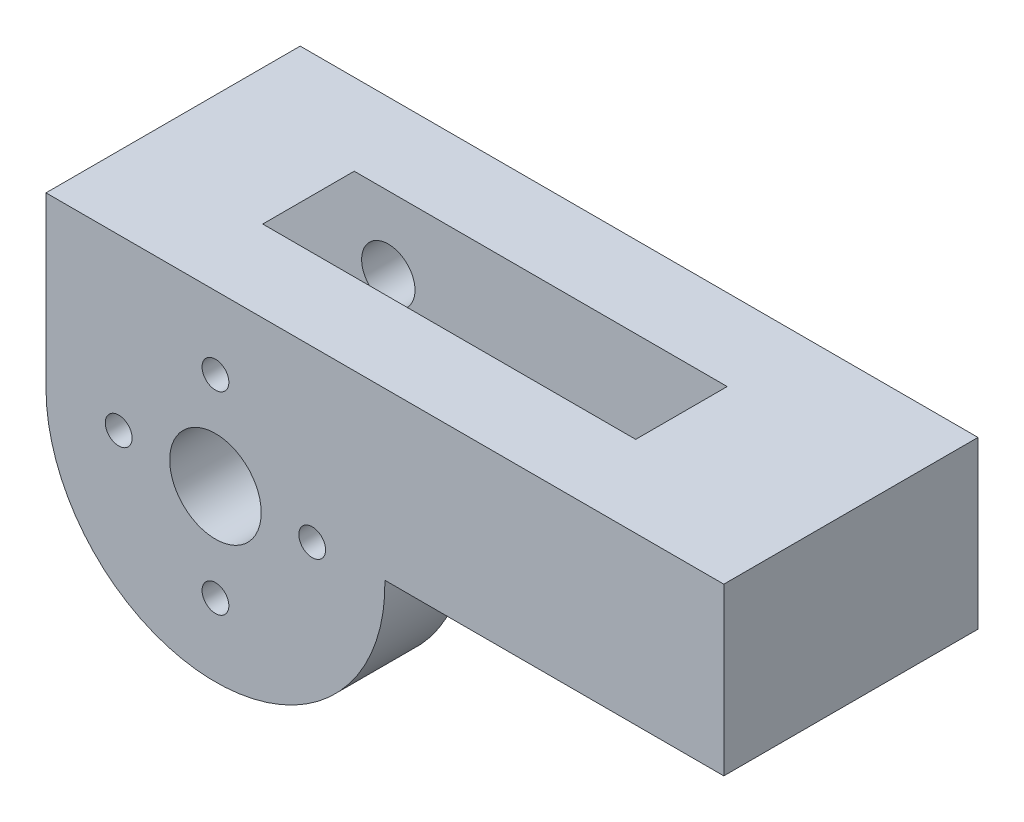
ISO-10303-21;
HEADER;
FILE_DESCRIPTION(('STEP AP214'),'2;1');
FILE_NAME('part.step','',(''),(''),'','','');
FILE_SCHEMA(('AUTOMOTIVE_DESIGN { 1 0 10303 214 1 1 1 1 }'));
ENDSEC;
DATA;
#1=APPLICATION_CONTEXT('core data for automotive mechanical design processes');
#2=APPLICATION_PROTOCOL_DEFINITION('international standard','automotive_design',2000,#1);
#3=PRODUCT_CONTEXT('',#1,'mechanical');
#4=PRODUCT('Part','Part','',(#3));
#5=PRODUCT_RELATED_PRODUCT_CATEGORY('part','',(#4));
#6=PRODUCT_DEFINITION_FORMATION('','',#4);
#7=PRODUCT_DEFINITION_CONTEXT('part definition',#1,'design');
#8=PRODUCT_DEFINITION('design','',#6,#7);
#9=PRODUCT_DEFINITION_SHAPE('','',#8);
#10=(LENGTH_UNIT() NAMED_UNIT(*) SI_UNIT(.MILLI.,.METRE.));
#11=(NAMED_UNIT(*) PLANE_ANGLE_UNIT() SI_UNIT($,.RADIAN.));
#12=(NAMED_UNIT(*) SI_UNIT($,.STERADIAN.) SOLID_ANGLE_UNIT());
#13=UNCERTAINTY_MEASURE_WITH_UNIT(LENGTH_MEASURE(1.E-05),#10,'distance_accuracy_value','');
#14=(GEOMETRIC_REPRESENTATION_CONTEXT(3) GLOBAL_UNCERTAINTY_ASSIGNED_CONTEXT((#13)) GLOBAL_UNIT_ASSIGNED_CONTEXT((#10,
#11,#12)) REPRESENTATION_CONTEXT('',''));
#15=CARTESIAN_POINT('',(0.,0.,0.));
#16=DIRECTION('',(0.,0.,1.));
#17=DIRECTION('',(1.,0.,0.));
#18=AXIS2_PLACEMENT_3D('',#15,#16,#17);
#19=CARTESIAN_POINT('',(0.,0.,9.525));
#20=DIRECTION('',(0.,0.,-1.));
#21=DIRECTION('',(-1.,0.,0.));
#22=AXIS2_PLACEMENT_3D('',#19,#20,#21);
#23=CYLINDRICAL_SURFACE('',#22,12.7);
#24=CARTESIAN_POINT('',(0.,0.,-3.429));
#25=DIRECTION('',(0.,0.,1.));
#26=DIRECTION('',(1.,0.,0.));
#27=AXIS2_PLACEMENT_3D('',#24,#25,#26);
#28=CIRCLE('',#27,12.7);
#29=CARTESIAN_POINT('',(-12.7,0.,-3.429));
#30=VERTEX_POINT('',#29);
#31=CARTESIAN_POINT('',(12.6974597459492,0.254000000000002,-3.429));
#32=VERTEX_POINT('',#31);
#33=EDGE_CURVE('E141',#30,#32,#28,.T.);
#34=ORIENTED_EDGE('',*,*,#33,.F.);
#35=DIRECTION('',(0.,0.,-1.));
#36=VECTOR('',#35,1.);
#37=CARTESIAN_POINT('',(-12.7,0.,9.525));
#38=LINE('',#37,#36);
#39=CARTESIAN_POINT('',(-12.7,0.,-9.525));
#40=VERTEX_POINT('',#39);
#41=EDGE_CURVE('E185',#30,#40,#38,.T.);
#42=ORIENTED_EDGE('',*,*,#41,.T.);
#43=CARTESIAN_POINT('',(0.,0.,-9.525));
#44=DIRECTION('',(0.,0.,1.));
#45=DIRECTION('',(1.,0.,0.));
#46=AXIS2_PLACEMENT_3D('',#43,#44,#45);
#47=CIRCLE('',#46,12.7);
#48=CARTESIAN_POINT('',(12.6974597459492,0.254000000000002,-9.525));
#49=VERTEX_POINT('',#48);
#50=EDGE_CURVE('E170',#40,#49,#47,.T.);
#51=ORIENTED_EDGE('',*,*,#50,.T.);
#52=DIRECTION('',(0.,0.,-1.));
#53=VECTOR('',#52,1.);
#54=CARTESIAN_POINT('',(12.6974597459492,0.254000000000002,9.525));
#55=LINE('',#54,#53);
#56=EDGE_CURVE('E208',#32,#49,#55,.T.);
#57=ORIENTED_EDGE('',*,*,#56,.F.);
#58=EDGE_LOOP('',(#34,#42,#51,#57));
#59=FACE_BOUND('',#58,.T.);
#60=ADVANCED_FACE('F40',(#59),#23,.T.);
#61=CARTESIAN_POINT('',(38.1,0.254000000000005,9.525));
#62=DIRECTION('',(0.,1.,0.));
#63=DIRECTION('',(-1.,0.,0.));
#64=AXIS2_PLACEMENT_3D('',#61,#62,#63);
#65=PLANE('',#64);
#66=DIRECTION('',(1.,0.,0.));
#67=VECTOR('',#66,1.);
#68=CARTESIAN_POINT('',(-399987.3,0.253999999927146,-3.429));
#69=LINE('',#68,#67);
#70=CARTESIAN_POINT('',(25.3999999999661,0.253999999983989,-3.429));
#71=VERTEX_POINT('',#70);
#72=EDGE_CURVE('E136',#32,#71,#69,.T.);
#73=ORIENTED_EDGE('',*,*,#72,.F.);
#74=ORIENTED_EDGE('',*,*,#56,.T.);
#75=DIRECTION('',(1.,0.,0.));
#76=VECTOR('',#75,1.);
#77=CARTESIAN_POINT('',(38.1,0.254000000000005,-9.525));
#78=LINE('',#77,#76);
#79=CARTESIAN_POINT('',(38.1,0.254000000000005,-9.525));
#80=VERTEX_POINT('',#79);
#81=EDGE_CURVE('E188',#49,#80,#78,.T.);
#82=ORIENTED_EDGE('',*,*,#81,.T.);
#83=DIRECTION('',(0.,0.,-1.));
#84=VECTOR('',#83,1.);
#85=CARTESIAN_POINT('',(38.1,0.254000000000005,9.525));
#86=LINE('',#85,#84);
#87=CARTESIAN_POINT('',(38.1,0.254000000000005,9.525));
#88=VERTEX_POINT('',#87);
#89=EDGE_CURVE('E205',#88,#80,#86,.T.);
#90=ORIENTED_EDGE('',*,*,#89,.F.);
#91=DIRECTION('',(1.,0.,0.));
#92=VECTOR('',#91,1.);
#93=CARTESIAN_POINT('',(38.1,0.254000000000005,9.525));
#94=LINE('',#93,#92);
#95=CARTESIAN_POINT('',(12.6974597459492,0.254000000000002,9.525));
#96=VERTEX_POINT('',#95);
#97=EDGE_CURVE('E176',#96,#88,#94,.T.);
#98=ORIENTED_EDGE('',*,*,#97,.F.);
#99=CARTESIAN_POINT('',(12.6974597459492,0.254000000000002,3.429));
#100=VERTEX_POINT('',#99);
#101=EDGE_CURVE('E49',#96,#100,#55,.T.);
#102=ORIENTED_EDGE('',*,*,#101,.T.);
#103=DIRECTION('',(1.,0.,0.));
#104=VECTOR('',#103,1.);
#105=CARTESIAN_POINT('',(38.1,0.254000000000005,3.429));
#106=LINE('',#105,#104);
#107=CARTESIAN_POINT('',(25.3999999999661,0.253999999983989,3.429));
#108=VERTEX_POINT('',#107);
#109=EDGE_CURVE('E148',#100,#108,#106,.T.);
#110=ORIENTED_EDGE('',*,*,#109,.T.);
#111=DIRECTION('',(0.,0.,1.));
#112=VECTOR('',#111,1.);
#113=CARTESIAN_POINT('',(25.3999999999661,0.253999999983989,-3.429));
#114=LINE('',#113,#112);
#115=EDGE_CURVE('E132',#71,#108,#114,.T.);
#116=ORIENTED_EDGE('',*,*,#115,.F.);
#117=EDGE_LOOP('',(#73,#74,#82,#90,#98,#102,#110,#116));
#118=FACE_BOUND('',#117,.T.);
#119=ADVANCED_FACE('F146',(#118),#65,.F.);
#120=CARTESIAN_POINT('',(-12.7,12.7,9.525));
#121=DIRECTION('',(0.,-1.,0.));
#122=DIRECTION('',(0.,0.,-1.));
#123=AXIS2_PLACEMENT_3D('',#120,#121,#122);
#124=PLANE('',#123);
#125=DIRECTION('',(-1.,0.,0.));
#126=VECTOR('',#125,1.);
#127=CARTESIAN_POINT('',(-12.7,12.7,-9.525));
#128=LINE('',#127,#126);
#129=CARTESIAN_POINT('',(38.1,12.7,-9.525));
#130=VERTEX_POINT('',#129);
#131=CARTESIAN_POINT('',(-12.7,12.7,-9.525));
#132=VERTEX_POINT('',#131);
#133=EDGE_CURVE('E192',#130,#132,#128,.T.);
#134=ORIENTED_EDGE('',*,*,#133,.T.);
#135=DIRECTION('',(0.,0.,-1.));
#136=VECTOR('',#135,1.);
#137=CARTESIAN_POINT('',(-12.7,12.7,9.525));
#138=LINE('',#137,#136);
#139=CARTESIAN_POINT('',(-12.7,12.7,9.525));
#140=VERTEX_POINT('',#139);
#141=EDGE_CURVE('E199',#140,#132,#138,.T.);
#142=ORIENTED_EDGE('',*,*,#141,.F.);
#143=DIRECTION('',(-1.,0.,0.));
#144=VECTOR('',#143,1.);
#145=CARTESIAN_POINT('',(-12.7,12.7,9.525));
#146=LINE('',#145,#144);
#147=CARTESIAN_POINT('',(38.1,12.7,9.525));
#148=VERTEX_POINT('',#147);
#149=EDGE_CURVE('E181',#148,#140,#146,.T.);
#150=ORIENTED_EDGE('',*,*,#149,.F.);
#151=DIRECTION('',(0.,0.,-1.));
#152=VECTOR('',#151,1.);
#153=CARTESIAN_POINT('',(38.1,12.7,9.525));
#154=LINE('',#153,#152);
#155=EDGE_CURVE('E202',#148,#130,#154,.T.);
#156=ORIENTED_EDGE('',*,*,#155,.T.);
#157=EDGE_LOOP('',(#134,#142,#150,#156));
#158=FACE_BOUND('',#157,.T.);
#159=DIRECTION('',(-1.,0.,0.));
#160=VECTOR('',#159,1.);
#161=CARTESIAN_POINT('',(-12.7,12.7,-3.429));
#162=LINE('',#161,#160);
#163=CARTESIAN_POINT('',(25.3999999999905,12.6999999999931,-3.429));
#164=VERTEX_POINT('',#163);
#165=CARTESIAN_POINT('',(-2.55266840776471,12.7,-3.429));
#166=VERTEX_POINT('',#165);
#167=EDGE_CURVE('E162',#164,#166,#162,.T.);
#168=ORIENTED_EDGE('',*,*,#167,.F.);
#169=DIRECTION('',(0.,0.,1.));
#170=VECTOR('',#169,1.);
#171=CARTESIAN_POINT('',(25.3999999999905,12.6999999999931,-3.429));
#172=LINE('',#171,#170);
#173=CARTESIAN_POINT('',(25.3999999999905,12.6999999999931,3.429));
#174=VERTEX_POINT('',#173);
#175=EDGE_CURVE('E134',#164,#174,#172,.T.);
#176=ORIENTED_EDGE('',*,*,#175,.T.);
#177=DIRECTION('',(-1.,0.,0.));
#178=VECTOR('',#177,1.);
#179=CARTESIAN_POINT('',(-399987.3,12.6999999999384,3.429));
#180=LINE('',#179,#178);
#181=CARTESIAN_POINT('',(-2.55266840776471,12.7,3.429));
#182=VERTEX_POINT('',#181);
#183=EDGE_CURVE('E57',#174,#182,#180,.T.);
#184=ORIENTED_EDGE('',*,*,#183,.T.);
#185=DIRECTION('',(0.,0.,1.));
#186=VECTOR('',#185,1.);
#187=CARTESIAN_POINT('',(-2.55266840776473,12.7,-3.429));
#188=LINE('',#187,#186);
#189=EDGE_CURVE('E164',#182,#166,#188,.F.);
#190=ORIENTED_EDGE('',*,*,#189,.T.);
#191=EDGE_LOOP('',(#168,#176,#184,#190));
#192=FACE_BOUND('',#191,.T.);
#193=ADVANCED_FACE('F269',(#158,#192),#124,.F.);
#194=CARTESIAN_POINT('',(-12.7,0.,9.525));
#195=DIRECTION('',(1.,0.,0.));
#196=DIRECTION('',(0.,0.,-1.));
#197=AXIS2_PLACEMENT_3D('',#194,#195,#196);
#198=PLANE('',#197);
#199=DIRECTION('',(0.,-1.,0.));
#200=VECTOR('',#199,1.);
#201=CARTESIAN_POINT('',(-12.7,0.,-3.429));
#202=LINE('',#201,#200);
#203=CARTESIAN_POINT('',(-12.7,2.55266840776471,-3.429));
#204=VERTEX_POINT('',#203);
#205=EDGE_CURVE('E159',#204,#30,#202,.T.);
#206=ORIENTED_EDGE('',*,*,#205,.F.);
#207=DIRECTION('',(0.,0.,1.));
#208=VECTOR('',#207,1.);
#209=CARTESIAN_POINT('',(-12.7,2.55266840776473,-3.429));
#210=LINE('',#209,#208);
#211=CARTESIAN_POINT('',(-12.7,2.55266840776471,3.429));
#212=VERTEX_POINT('',#211);
#213=EDGE_CURVE('E13',#204,#212,#210,.T.);
#214=ORIENTED_EDGE('',*,*,#213,.T.);
#215=DIRECTION('',(0.,-1.,0.));
#216=VECTOR('',#215,1.);
#217=CARTESIAN_POINT('',(-12.7,0.,3.429));
#218=LINE('',#217,#216);
#219=CARTESIAN_POINT('',(-12.7,0.,3.429));
#220=VERTEX_POINT('',#219);
#221=EDGE_CURVE('E154',#212,#220,#218,.T.);
#222=ORIENTED_EDGE('',*,*,#221,.T.);
#223=CARTESIAN_POINT('',(-12.7,0.,9.525));
#224=VERTEX_POINT('',#223);
#225=EDGE_CURVE('E196',#224,#220,#38,.T.);
#226=ORIENTED_EDGE('',*,*,#225,.F.);
#227=DIRECTION('',(0.,-1.,0.));
#228=VECTOR('',#227,1.);
#229=CARTESIAN_POINT('',(-12.7,0.,9.525));
#230=LINE('',#229,#228);
#231=EDGE_CURVE('E183',#140,#224,#230,.T.);
#232=ORIENTED_EDGE('',*,*,#231,.F.);
#233=ORIENTED_EDGE('',*,*,#141,.T.);
#234=DIRECTION('',(0.,-1.,0.));
#235=VECTOR('',#234,1.);
#236=CARTESIAN_POINT('',(-12.7,0.,-9.525));
#237=LINE('',#236,#235);
#238=EDGE_CURVE('E177',#132,#40,#237,.T.);
#239=ORIENTED_EDGE('',*,*,#238,.T.);
#240=ORIENTED_EDGE('',*,*,#41,.F.);
#241=EDGE_LOOP('',(#206,#214,#222,#226,#232,#233,#239,#240));
#242=FACE_BOUND('',#241,.T.);
#243=ADVANCED_FACE('F276',(#242),#198,.F.);
#244=CARTESIAN_POINT('',(0.,0.,9.525));
#245=DIRECTION('',(0.,0.,-1.));
#246=DIRECTION('',(-1.,0.,0.));
#247=AXIS2_PLACEMENT_3D('',#244,#245,#246);
#248=CYLINDRICAL_SURFACE('',#247,3.429);
#249=CARTESIAN_POINT('',(0.,0.,-9.525));
#250=DIRECTION('',(0.,0.,1.));
#251=DIRECTION('',(1.,0.,0.));
#252=AXIS2_PLACEMENT_3D('',#249,#250,#251);
#253=CIRCLE('',#252,3.429);
#254=CARTESIAN_POINT('',(3.429,0.,-9.525));
#255=VERTEX_POINT('',#254);
#256=EDGE_CURVE('E166',#255,#255,#253,.T.);
#257=ORIENTED_EDGE('',*,*,#256,.F.);
#258=EDGE_LOOP('',(#257));
#259=FACE_BOUND('',#258,.T.);
#260=CARTESIAN_POINT('',(0.,0.,-3.429));
#261=DIRECTION('',(0.,0.,1.));
#262=DIRECTION('',(1.,0.,0.));
#263=AXIS2_PLACEMENT_3D('',#260,#261,#262);
#264=CIRCLE('',#263,3.429);
#265=CARTESIAN_POINT('',(3.429,0.,-3.429));
#266=VERTEX_POINT('',#265);
#267=EDGE_CURVE('E158',#266,#266,#264,.T.);
#268=ORIENTED_EDGE('',*,*,#267,.T.);
#269=EDGE_LOOP('',(#268));
#270=FACE_BOUND('',#269,.T.);
#271=ADVANCED_FACE('F322',(#259,#270),#248,.F.);
#272=CARTESIAN_POINT('',(0.,0.,9.525));
#273=DIRECTION('',(0.,0.,1.));
#274=DIRECTION('',(1.,0.,0.));
#275=AXIS2_PLACEMENT_3D('',#272,#273,#274);
#276=PLANE('',#275);
#277=CARTESIAN_POINT('',(7.249999978,0.,9.525));
#278=DIRECTION('',(0.,0.,1.));
#279=DIRECTION('',(1.,0.,0.));
#280=AXIS2_PLACEMENT_3D('',#277,#278,#279);
#281=CIRCLE('',#280,1.004000024);
#282=CARTESIAN_POINT('',(8.254000002,0.,9.525));
#283=VERTEX_POINT('',#282);
#284=EDGE_CURVE('E252',#283,#283,#281,.T.);
#285=ORIENTED_EDGE('',*,*,#284,.F.);
#286=EDGE_LOOP('',(#285));
#287=FACE_BOUND('',#286,.T.);
#288=CARTESIAN_POINT('',(0.,-7.249999978,9.525));
#289=DIRECTION('',(0.,0.,1.));
#290=DIRECTION('',(1.,0.,0.));
#291=AXIS2_PLACEMENT_3D('',#288,#289,#290);
#292=CIRCLE('',#291,1.004000024);
#293=CARTESIAN_POINT('',(1.00400002399997,-7.249999978,9.525));
#294=VERTEX_POINT('',#293);
#295=EDGE_CURVE('E256',#294,#294,#292,.T.);
#296=ORIENTED_EDGE('',*,*,#295,.F.);
#297=EDGE_LOOP('',(#296));
#298=FACE_BOUND('',#297,.T.);
#299=CARTESIAN_POINT('',(-7.249999978,0.,9.525));
#300=DIRECTION('',(0.,0.,1.));
#301=DIRECTION('',(1.,0.,0.));
#302=AXIS2_PLACEMENT_3D('',#299,#300,#301);
#303=CIRCLE('',#302,1.004000024);
#304=CARTESIAN_POINT('',(-6.245999954,0.,9.525));
#305=VERTEX_POINT('',#304);
#306=EDGE_CURVE('E259',#305,#305,#303,.T.);
#307=ORIENTED_EDGE('',*,*,#306,.F.);
#308=EDGE_LOOP('',(#307));
#309=FACE_BOUND('',#308,.T.);
#310=CARTESIAN_POINT('',(0.,7.249999978,9.525));
#311=DIRECTION('',(0.,0.,1.));
#312=DIRECTION('',(1.,0.,0.));
#313=AXIS2_PLACEMENT_3D('',#310,#311,#312);
#314=CIRCLE('',#313,1.004000024);
#315=CARTESIAN_POINT('',(1.00400002400008,7.249999978,9.525));
#316=VERTEX_POINT('',#315);
#317=EDGE_CURVE('E251',#316,#316,#314,.T.);
#318=ORIENTED_EDGE('',*,*,#317,.F.);
#319=EDGE_LOOP('',(#318));
#320=FACE_BOUND('',#319,.T.);
#321=CARTESIAN_POINT('',(0.,0.,9.525));
#322=DIRECTION('',(0.,0.,1.));
#323=DIRECTION('',(1.,0.,0.));
#324=AXIS2_PLACEMENT_3D('',#321,#322,#323);
#325=CIRCLE('',#324,12.7);
#326=EDGE_CURVE('E173',#224,#96,#325,.T.);
#327=ORIENTED_EDGE('',*,*,#326,.T.);
#328=ORIENTED_EDGE('',*,*,#97,.T.);
#329=DIRECTION('',(0.,1.,0.));
#330=VECTOR('',#329,1.);
#331=CARTESIAN_POINT('',(38.1,12.7,9.525));
#332=LINE('',#331,#330);
#333=EDGE_CURVE('E179',#88,#148,#332,.T.);
#334=ORIENTED_EDGE('',*,*,#333,.T.);
#335=ORIENTED_EDGE('',*,*,#149,.T.);
#336=ORIENTED_EDGE('',*,*,#231,.T.);
#337=EDGE_LOOP('',(#327,#328,#334,#335,#336));
#338=FACE_BOUND('',#337,.T.);
#339=CARTESIAN_POINT('',(0.,0.,9.525));
#340=DIRECTION('',(0.,0.,1.));
#341=DIRECTION('',(1.,0.,0.));
#342=AXIS2_PLACEMENT_3D('',#339,#340,#341);
#343=CIRCLE('',#342,3.429);
#344=CARTESIAN_POINT('',(3.429,0.,9.525));
#345=VERTEX_POINT('',#344);
#346=EDGE_CURVE('E167',#345,#345,#343,.T.);
#347=ORIENTED_EDGE('',*,*,#346,.F.);
#348=EDGE_LOOP('',(#347));
#349=FACE_BOUND('',#348,.T.);
#350=ADVANCED_FACE('F298',(#287,#298,#309,#320,#338,#349),#276,.T.);
#351=CARTESIAN_POINT('',(0.,0.,-9.525));
#352=DIRECTION('',(0.,0.,1.));
#353=DIRECTION('',(1.,0.,0.));
#354=AXIS2_PLACEMENT_3D('',#351,#352,#353);
#355=PLANE('',#354);
#356=CARTESIAN_POINT('',(-7.249999978,0.,-9.525));
#357=DIRECTION('',(0.,0.,-1.));
#358=DIRECTION('',(-1.,0.,0.));
#359=AXIS2_PLACEMENT_3D('',#356,#357,#358);
#360=CIRCLE('',#359,2.000000064);
#361=CARTESIAN_POINT('',(-9.250000042,0.,-9.525));
#362=VERTEX_POINT('',#361);
#363=EDGE_CURVE('E433',#362,#362,#360,.T.);
#364=ORIENTED_EDGE('',*,*,#363,.F.);
#365=EDGE_LOOP('',(#364));
#366=FACE_BOUND('',#365,.T.);
#367=CARTESIAN_POINT('',(0.,-7.249999978,-9.525));
#368=DIRECTION('',(0.,0.,-1.));
#369=DIRECTION('',(-1.,0.,0.));
#370=AXIS2_PLACEMENT_3D('',#367,#368,#369);
#371=CIRCLE('',#370,2.000000064);
#372=CARTESIAN_POINT('',(-2.00000006400002,-7.249999978,-9.525));
#373=VERTEX_POINT('',#372);
#374=EDGE_CURVE('E430',#373,#373,#371,.T.);
#375=ORIENTED_EDGE('',*,*,#374,.F.);
#376=EDGE_LOOP('',(#375));
#377=FACE_BOUND('',#376,.T.);
#378=CARTESIAN_POINT('',(7.24999997800002,0.,-9.525));
#379=DIRECTION('',(0.,0.,-1.));
#380=DIRECTION('',(-1.,0.,0.));
#381=AXIS2_PLACEMENT_3D('',#378,#379,#380);
#382=CIRCLE('',#381,2.00000006399997);
#383=CARTESIAN_POINT('',(5.24999991400006,0.,-9.525));
#384=VERTEX_POINT('',#383);
#385=EDGE_CURVE('E424',#384,#384,#382,.T.);
#386=ORIENTED_EDGE('',*,*,#385,.F.);
#387=EDGE_LOOP('',(#386));
#388=FACE_BOUND('',#387,.T.);
#389=CARTESIAN_POINT('',(0.,7.24999997800002,-9.525));
#390=DIRECTION('',(0.,0.,-1.));
#391=DIRECTION('',(-1.,0.,0.));
#392=AXIS2_PLACEMENT_3D('',#389,#390,#391);
#393=CIRCLE('',#392,2.00000006399996);
#394=CARTESIAN_POINT('',(-2.0000000639999,7.24999997800002,-9.525));
#395=VERTEX_POINT('',#394);
#396=EDGE_CURVE('E419',#395,#395,#393,.T.);
#397=ORIENTED_EDGE('',*,*,#396,.F.);
#398=EDGE_LOOP('',(#397));
#399=FACE_BOUND('',#398,.T.);
#400=ORIENTED_EDGE('',*,*,#50,.F.);
#401=ORIENTED_EDGE('',*,*,#238,.F.);
#402=ORIENTED_EDGE('',*,*,#133,.F.);
#403=DIRECTION('',(0.,1.,0.));
#404=VECTOR('',#403,1.);
#405=CARTESIAN_POINT('',(38.1,12.7,-9.525));
#406=LINE('',#405,#404);
#407=EDGE_CURVE('E190',#80,#130,#406,.T.);
#408=ORIENTED_EDGE('',*,*,#407,.F.);
#409=ORIENTED_EDGE('',*,*,#81,.F.);
#410=EDGE_LOOP('',(#400,#401,#402,#408,#409));
#411=FACE_BOUND('',#410,.T.);
#412=ORIENTED_EDGE('',*,*,#256,.T.);
#413=EDGE_LOOP('',(#412));
#414=FACE_BOUND('',#413,.T.);
#415=ADVANCED_FACE('F285',(#366,#377,#388,#399,#411,#414),#355,.F.);
#416=ORIENTED_EDGE('',*,*,#225,.T.);
#417=CARTESIAN_POINT('',(0.,0.,3.429));
#418=DIRECTION('',(0.,0.,1.));
#419=DIRECTION('',(1.,0.,0.));
#420=AXIS2_PLACEMENT_3D('',#417,#418,#419);
#421=CIRCLE('',#420,12.7);
#422=EDGE_CURVE('E65',#220,#100,#421,.T.);
#423=ORIENTED_EDGE('',*,*,#422,.T.);
#424=ORIENTED_EDGE('',*,*,#101,.F.);
#425=ORIENTED_EDGE('',*,*,#326,.F.);
#426=EDGE_LOOP('',(#416,#423,#424,#425));
#427=FACE_BOUND('',#426,.T.);
#428=ADVANCED_FACE('F42',(#427),#23,.T.);
#429=CARTESIAN_POINT('',(38.1,12.7,9.525));
#430=DIRECTION('',(-1.,0.,0.));
#431=DIRECTION('',(0.,-1.,0.));
#432=AXIS2_PLACEMENT_3D('',#429,#430,#431);
#433=PLANE('',#432);
#434=ORIENTED_EDGE('',*,*,#407,.T.);
#435=ORIENTED_EDGE('',*,*,#155,.F.);
#436=ORIENTED_EDGE('',*,*,#333,.F.);
#437=ORIENTED_EDGE('',*,*,#89,.T.);
#438=EDGE_LOOP('',(#434,#435,#436,#437));
#439=FACE_BOUND('',#438,.T.);
#440=ADVANCED_FACE('F291',(#439),#433,.F.);
#441=CARTESIAN_POINT('',(0.,0.,3.429));
#442=DIRECTION('',(0.,0.,1.));
#443=DIRECTION('',(1.,0.,0.));
#444=AXIS2_PLACEMENT_3D('',#441,#442,#443);
#445=CIRCLE('',#444,3.429);
#446=CARTESIAN_POINT('',(3.429,0.,3.429));
#447=VERTEX_POINT('',#446);
#448=EDGE_CURVE('E150',#447,#447,#445,.T.);
#449=ORIENTED_EDGE('',*,*,#448,.F.);
#450=EDGE_LOOP('',(#449));
#451=FACE_BOUND('',#450,.T.);
#452=ORIENTED_EDGE('',*,*,#346,.T.);
#453=EDGE_LOOP('',(#452));
#454=FACE_BOUND('',#453,.T.);
#455=ADVANCED_FACE('F308',(#451,#454),#248,.F.);
#456=CARTESIAN_POINT('',(0.,0.,-3.429));
#457=DIRECTION('',(0.,0.,1.));
#458=DIRECTION('',(1.,0.,0.));
#459=AXIS2_PLACEMENT_3D('',#456,#457,#458);
#460=CYLINDRICAL_SURFACE('',#459,12.954);
#461=CARTESIAN_POINT('',(0.,0.,3.429));
#462=DIRECTION('',(0.,0.,1.));
#463=DIRECTION('',(1.,0.,0.));
#464=AXIS2_PLACEMENT_3D('',#461,#462,#463);
#465=CIRCLE('',#464,12.954);
#466=EDGE_CURVE('E255',#182,#212,#465,.T.);
#467=ORIENTED_EDGE('',*,*,#466,.T.);
#468=ORIENTED_EDGE('',*,*,#213,.F.);
#469=CARTESIAN_POINT('',(0.,0.,-3.429));
#470=DIRECTION('',(0.,0.,1.));
#471=DIRECTION('',(1.,0.,0.));
#472=AXIS2_PLACEMENT_3D('',#469,#470,#471);
#473=CIRCLE('',#472,12.954);
#474=EDGE_CURVE('E144',#166,#204,#473,.T.);
#475=ORIENTED_EDGE('',*,*,#474,.F.);
#476=ORIENTED_EDGE('',*,*,#189,.F.);
#477=EDGE_LOOP('',(#467,#468,#475,#476));
#478=FACE_BOUND('',#477,.T.);
#479=ADVANCED_FACE('F274',(#478),#460,.F.);
#480=CARTESIAN_POINT('',(0.,0.,-3.429));
#481=DIRECTION('',(0.,0.,1.));
#482=DIRECTION('',(1.,0.,0.));
#483=AXIS2_PLACEMENT_3D('',#480,#481,#482);
#484=PLANE('',#483);
#485=CARTESIAN_POINT('',(-7.249999978,0.,-3.429));
#486=DIRECTION('',(0.,0.,1.));
#487=DIRECTION('',(1.,0.,0.));
#488=AXIS2_PLACEMENT_3D('',#485,#486,#487);
#489=CIRCLE('',#488,2.000000064);
#490=CARTESIAN_POINT('',(-5.249999914,0.,-3.429));
#491=VERTEX_POINT('',#490);
#492=EDGE_CURVE('E248',#491,#491,#489,.T.);
#493=ORIENTED_EDGE('',*,*,#492,.F.);
#494=EDGE_LOOP('',(#493));
#495=FACE_BOUND('',#494,.T.);
#496=CARTESIAN_POINT('',(0.,-7.249999978,-3.429));
#497=DIRECTION('',(0.,0.,1.));
#498=DIRECTION('',(1.,0.,0.));
#499=AXIS2_PLACEMENT_3D('',#496,#497,#498);
#500=CIRCLE('',#499,2.000000064);
#501=CARTESIAN_POINT('',(2.00000006399997,-7.249999978,-3.429));
#502=VERTEX_POINT('',#501);
#503=EDGE_CURVE('E236',#502,#502,#500,.T.);
#504=ORIENTED_EDGE('',*,*,#503,.F.);
#505=EDGE_LOOP('',(#504));
#506=FACE_BOUND('',#505,.T.);
#507=CARTESIAN_POINT('',(7.24999997800002,0.,-3.429));
#508=DIRECTION('',(0.,0.,1.));
#509=DIRECTION('',(1.,0.,0.));
#510=AXIS2_PLACEMENT_3D('',#507,#508,#509);
#511=CIRCLE('',#510,2.00000006399997);
#512=CARTESIAN_POINT('',(9.25000004199999,0.,-3.429));
#513=VERTEX_POINT('',#512);
#514=EDGE_CURVE('E233',#513,#513,#511,.T.);
#515=ORIENTED_EDGE('',*,*,#514,.F.);
#516=EDGE_LOOP('',(#515));
#517=FACE_BOUND('',#516,.T.);
#518=CARTESIAN_POINT('',(0.,7.24999997800002,-3.429));
#519=DIRECTION('',(0.,0.,1.));
#520=DIRECTION('',(1.,0.,0.));
#521=AXIS2_PLACEMENT_3D('',#518,#519,#520);
#522=CIRCLE('',#521,2.00000006399996);
#523=CARTESIAN_POINT('',(2.00000006400001,7.24999997800002,-3.429));
#524=VERTEX_POINT('',#523);
#525=EDGE_CURVE('E230',#524,#524,#522,.T.);
#526=ORIENTED_EDGE('',*,*,#525,.F.);
#527=EDGE_LOOP('',(#526));
#528=FACE_BOUND('',#527,.T.);
#529=ORIENTED_EDGE('',*,*,#267,.F.);
#530=EDGE_LOOP('',(#529));
#531=FACE_BOUND('',#530,.T.);
#532=ORIENTED_EDGE('',*,*,#167,.T.);
#533=ORIENTED_EDGE('',*,*,#474,.T.);
#534=ORIENTED_EDGE('',*,*,#205,.T.);
#535=ORIENTED_EDGE('',*,*,#33,.T.);
#536=ORIENTED_EDGE('',*,*,#72,.T.);
#537=DIRECTION('',(0.,1.,0.));
#538=VECTOR('',#537,1.);
#539=CARTESIAN_POINT('',(25.4000000000474,-291586.03,-3.429));
#540=LINE('',#539,#538);
#541=EDGE_CURVE('E127',#71,#164,#540,.T.);
#542=ORIENTED_EDGE('',*,*,#541,.T.);
#543=EDGE_LOOP('',(#532,#533,#534,#535,#536,#542));
#544=FACE_BOUND('',#543,.T.);
#545=ADVANCED_FACE('F139',(#495,#506,#517,#528,#531,#544),#484,.T.);
#546=CARTESIAN_POINT('',(0.,0.,3.429));
#547=DIRECTION('',(0.,0.,1.));
#548=DIRECTION('',(1.,0.,0.));
#549=AXIS2_PLACEMENT_3D('',#546,#547,#548);
#550=PLANE('',#549);
#551=CARTESIAN_POINT('',(-7.249999978,0.,3.429));
#552=DIRECTION('',(0.,0.,1.));
#553=DIRECTION('',(1.,0.,0.));
#554=AXIS2_PLACEMENT_3D('',#551,#552,#553);
#555=CIRCLE('',#554,2.000000064);
#556=CARTESIAN_POINT('',(-5.249999914,0.,3.429));
#557=VERTEX_POINT('',#556);
#558=EDGE_CURVE('E44',#557,#557,#555,.T.);
#559=ORIENTED_EDGE('',*,*,#558,.T.);
#560=EDGE_LOOP('',(#559));
#561=FACE_BOUND('',#560,.T.);
#562=CARTESIAN_POINT('',(0.,-7.249999978,3.429));
#563=DIRECTION('',(0.,0.,1.));
#564=DIRECTION('',(1.,0.,0.));
#565=AXIS2_PLACEMENT_3D('',#562,#563,#564);
#566=CIRCLE('',#565,2.000000064);
#567=CARTESIAN_POINT('',(2.00000006399997,-7.249999978,3.429));
#568=VERTEX_POINT('',#567);
#569=EDGE_CURVE('E234',#568,#568,#566,.T.);
#570=ORIENTED_EDGE('',*,*,#569,.T.);
#571=EDGE_LOOP('',(#570));
#572=FACE_BOUND('',#571,.T.);
#573=CARTESIAN_POINT('',(7.24999997800002,0.,3.429));
#574=DIRECTION('',(0.,0.,1.));
#575=DIRECTION('',(1.,0.,0.));
#576=AXIS2_PLACEMENT_3D('',#573,#574,#575);
#577=CIRCLE('',#576,2.00000006399997);
#578=CARTESIAN_POINT('',(9.25000004199999,0.,3.429));
#579=VERTEX_POINT('',#578);
#580=EDGE_CURVE('E231',#579,#579,#577,.T.);
#581=ORIENTED_EDGE('',*,*,#580,.T.);
#582=EDGE_LOOP('',(#581));
#583=FACE_BOUND('',#582,.T.);
#584=CARTESIAN_POINT('',(0.,7.24999997800002,3.429));
#585=DIRECTION('',(0.,0.,1.));
#586=DIRECTION('',(1.,0.,0.));
#587=AXIS2_PLACEMENT_3D('',#584,#585,#586);
#588=CIRCLE('',#587,2.00000006399996);
#589=CARTESIAN_POINT('',(2.00000006400001,7.24999997800002,3.429));
#590=VERTEX_POINT('',#589);
#591=EDGE_CURVE('E227',#590,#590,#588,.T.);
#592=ORIENTED_EDGE('',*,*,#591,.T.);
#593=EDGE_LOOP('',(#592));
#594=FACE_BOUND('',#593,.T.);
#595=ORIENTED_EDGE('',*,*,#448,.T.);
#596=EDGE_LOOP('',(#595));
#597=FACE_BOUND('',#596,.T.);
#598=ORIENTED_EDGE('',*,*,#183,.F.);
#599=DIRECTION('',(0.,1.,0.));
#600=VECTOR('',#599,1.);
#601=CARTESIAN_POINT('',(25.4000000000474,-291586.03,3.429));
#602=LINE('',#601,#600);
#603=EDGE_CURVE('E268',#108,#174,#602,.T.);
#604=ORIENTED_EDGE('',*,*,#603,.F.);
#605=ORIENTED_EDGE('',*,*,#109,.F.);
#606=ORIENTED_EDGE('',*,*,#422,.F.);
#607=ORIENTED_EDGE('',*,*,#221,.F.);
#608=ORIENTED_EDGE('',*,*,#466,.F.);
#609=EDGE_LOOP('',(#598,#604,#605,#606,#607,#608));
#610=FACE_BOUND('',#609,.T.);
#611=ADVANCED_FACE('F335',(#561,#572,#583,#594,#597,#610),#550,.F.);
#612=CARTESIAN_POINT('',(25.4000000000474,-291586.03,-3.429));
#613=DIRECTION('',(1.,0.,0.));
#614=DIRECTION('',(0.,1.,0.));
#615=AXIS2_PLACEMENT_3D('',#612,#613,#614);
#616=PLANE('',#615);
#617=ORIENTED_EDGE('',*,*,#603,.T.);
#618=ORIENTED_EDGE('',*,*,#175,.F.);
#619=ORIENTED_EDGE('',*,*,#541,.F.);
#620=ORIENTED_EDGE('',*,*,#115,.T.);
#621=EDGE_LOOP('',(#617,#618,#619,#620));
#622=FACE_BOUND('',#621,.T.);
#623=ADVANCED_FACE('F130',(#622),#616,.F.);
#624=CARTESIAN_POINT('',(0.,7.249999978,-9.525));
#625=DIRECTION('',(0.,0.,1.));
#626=DIRECTION('',(1.,0.,0.));
#627=AXIS2_PLACEMENT_3D('',#624,#625,#626);
#628=CYLINDRICAL_SURFACE('',#627,1.004000024);
#629=CARTESIAN_POINT('',(0.,7.249999978,5.429000064));
#630=DIRECTION('',(0.,0.,1.));
#631=DIRECTION('',(1.,0.,0.));
#632=AXIS2_PLACEMENT_3D('',#629,#630,#631);
#633=CIRCLE('',#632,1.004000024);
#634=CARTESIAN_POINT('',(1.00400002400008,7.249999978,5.429000064));
#635=VERTEX_POINT('',#634);
#636=EDGE_CURVE('E224',#635,#635,#633,.F.);
#637=ORIENTED_EDGE('',*,*,#636,.T.);
#638=EDGE_LOOP('',(#637));
#639=FACE_BOUND('',#638,.T.);
#640=ORIENTED_EDGE('',*,*,#317,.T.);
#641=EDGE_LOOP('',(#640));
#642=FACE_BOUND('',#641,.T.);
#643=ADVANCED_FACE('F334',(#639,#642),#628,.F.);
#644=CARTESIAN_POINT('',(-7.249999978,0.,-9.525));
#645=DIRECTION('',(0.,0.,1.));
#646=DIRECTION('',(1.,0.,0.));
#647=AXIS2_PLACEMENT_3D('',#644,#645,#646);
#648=CYLINDRICAL_SURFACE('',#647,1.004000024);
#649=CARTESIAN_POINT('',(-7.249999978,0.,5.429000064));
#650=DIRECTION('',(0.,0.,1.));
#651=DIRECTION('',(1.,0.,0.));
#652=AXIS2_PLACEMENT_3D('',#649,#650,#651);
#653=CIRCLE('',#652,1.004000024);
#654=CARTESIAN_POINT('',(-6.245999954,0.,5.429000064));
#655=VERTEX_POINT('',#654);
#656=EDGE_CURVE('E221',#655,#655,#653,.F.);
#657=ORIENTED_EDGE('',*,*,#656,.T.);
#658=EDGE_LOOP('',(#657));
#659=FACE_BOUND('',#658,.T.);
#660=ORIENTED_EDGE('',*,*,#306,.T.);
#661=EDGE_LOOP('',(#660));
#662=FACE_BOUND('',#661,.T.);
#663=ADVANCED_FACE('F344',(#659,#662),#648,.F.);
#664=CARTESIAN_POINT('',(0.,-7.249999978,-9.525));
#665=DIRECTION('',(0.,0.,1.));
#666=DIRECTION('',(1.,0.,0.));
#667=AXIS2_PLACEMENT_3D('',#664,#665,#666);
#668=CYLINDRICAL_SURFACE('',#667,1.004000024);
#669=CARTESIAN_POINT('',(0.,-7.249999978,5.429000064));
#670=DIRECTION('',(0.,0.,1.));
#671=DIRECTION('',(1.,0.,0.));
#672=AXIS2_PLACEMENT_3D('',#669,#670,#671);
#673=CIRCLE('',#672,1.004000024);
#674=CARTESIAN_POINT('',(1.00400002399997,-7.249999978,5.429000064));
#675=VERTEX_POINT('',#674);
#676=EDGE_CURVE('E217',#675,#675,#673,.F.);
#677=ORIENTED_EDGE('',*,*,#676,.T.);
#678=EDGE_LOOP('',(#677));
#679=FACE_BOUND('',#678,.T.);
#680=ORIENTED_EDGE('',*,*,#295,.T.);
#681=EDGE_LOOP('',(#680));
#682=FACE_BOUND('',#681,.T.);
#683=ADVANCED_FACE('F348',(#679,#682),#668,.F.);
#684=CARTESIAN_POINT('',(7.249999978,0.,-9.525));
#685=DIRECTION('',(0.,0.,1.));
#686=DIRECTION('',(1.,0.,0.));
#687=AXIS2_PLACEMENT_3D('',#684,#685,#686);
#688=CYLINDRICAL_SURFACE('',#687,1.004000024);
#689=CARTESIAN_POINT('',(7.249999978,0.,5.429000064));
#690=DIRECTION('',(0.,0.,1.));
#691=DIRECTION('',(1.,0.,0.));
#692=AXIS2_PLACEMENT_3D('',#689,#690,#691);
#693=CIRCLE('',#692,1.004000024);
#694=CARTESIAN_POINT('',(8.254000002,0.,5.429000064));
#695=VERTEX_POINT('',#694);
#696=EDGE_CURVE('E214',#695,#695,#693,.F.);
#697=ORIENTED_EDGE('',*,*,#696,.T.);
#698=EDGE_LOOP('',(#697));
#699=FACE_BOUND('',#698,.T.);
#700=ORIENTED_EDGE('',*,*,#284,.T.);
#701=EDGE_LOOP('',(#700));
#702=FACE_BOUND('',#701,.T.);
#703=ADVANCED_FACE('F352',(#699,#702),#688,.F.);
#704=CARTESIAN_POINT('',(0.,0.,5.429000064));
#705=DIRECTION('',(0.,0.,1.));
#706=DIRECTION('',(1.,0.,0.));
#707=AXIS2_PLACEMENT_3D('',#704,#705,#706);
#708=PLANE('',#707);
#709=CARTESIAN_POINT('',(7.24999997800002,0.,5.429000064));
#710=DIRECTION('',(0.,0.,1.));
#711=DIRECTION('',(1.,0.,0.));
#712=AXIS2_PLACEMENT_3D('',#709,#710,#711);
#713=CIRCLE('',#712,2.00000006399997);
#714=CARTESIAN_POINT('',(9.25000004199999,0.,5.429000064));
#715=VERTEX_POINT('',#714);
#716=EDGE_CURVE('E422',#715,#715,#713,.F.);
#717=ORIENTED_EDGE('',*,*,#716,.T.);
#718=EDGE_LOOP('',(#717));
#719=FACE_BOUND('',#718,.T.);
#720=ORIENTED_EDGE('',*,*,#696,.F.);
#721=EDGE_LOOP('',(#720));
#722=FACE_BOUND('',#721,.T.);
#723=ADVANCED_FACE('F356',(#719,#722),#708,.F.);
#724=CARTESIAN_POINT('',(7.24999997800002,0.,13.0858545585117));
#725=DIRECTION('',(0.,0.,-1.));
#726=DIRECTION('',(-1.,0.,0.));
#727=AXIS2_PLACEMENT_3D('',#724,#725,#726);
#728=CYLINDRICAL_SURFACE('',#727,2.00000006399997);
#729=ORIENTED_EDGE('',*,*,#716,.F.);
#730=EDGE_LOOP('',(#729));
#731=FACE_BOUND('',#730,.T.);
#732=ORIENTED_EDGE('',*,*,#580,.F.);
#733=EDGE_LOOP('',(#732));
#734=FACE_BOUND('',#733,.T.);
#735=ADVANCED_FACE('F372',(#731,#734),#728,.F.);
#736=CARTESIAN_POINT('',(0.,0.,5.429000064));
#737=DIRECTION('',(0.,0.,1.));
#738=DIRECTION('',(1.,0.,0.));
#739=AXIS2_PLACEMENT_3D('',#736,#737,#738);
#740=PLANE('',#739);
#741=CARTESIAN_POINT('',(0.,-7.249999978,5.429000064));
#742=DIRECTION('',(0.,0.,1.));
#743=DIRECTION('',(1.,0.,0.));
#744=AXIS2_PLACEMENT_3D('',#741,#742,#743);
#745=CIRCLE('',#744,2.000000064);
#746=CARTESIAN_POINT('',(2.00000006399997,-7.249999978,5.429000064));
#747=VERTEX_POINT('',#746);
#748=EDGE_CURVE('E427',#747,#747,#745,.F.);
#749=ORIENTED_EDGE('',*,*,#748,.T.);
#750=EDGE_LOOP('',(#749));
#751=FACE_BOUND('',#750,.T.);
#752=ORIENTED_EDGE('',*,*,#676,.F.);
#753=EDGE_LOOP('',(#752));
#754=FACE_BOUND('',#753,.T.);
#755=ADVANCED_FACE('F381',(#751,#754),#740,.F.);
#756=CARTESIAN_POINT('',(0.,-7.249999978,13.0858545585117));
#757=DIRECTION('',(0.,0.,-1.));
#758=DIRECTION('',(-1.,0.,0.));
#759=AXIS2_PLACEMENT_3D('',#756,#757,#758);
#760=CYLINDRICAL_SURFACE('',#759,2.000000064);
#761=ORIENTED_EDGE('',*,*,#748,.F.);
#762=EDGE_LOOP('',(#761));
#763=FACE_BOUND('',#762,.T.);
#764=ORIENTED_EDGE('',*,*,#569,.F.);
#765=EDGE_LOOP('',(#764));
#766=FACE_BOUND('',#765,.T.);
#767=ADVANCED_FACE('F380',(#763,#766),#760,.F.);
#768=CARTESIAN_POINT('',(0.,0.,5.429000064));
#769=DIRECTION('',(0.,0.,1.));
#770=DIRECTION('',(1.,0.,0.));
#771=AXIS2_PLACEMENT_3D('',#768,#769,#770);
#772=PLANE('',#771);
#773=CARTESIAN_POINT('',(-7.249999978,0.,5.429000064));
#774=DIRECTION('',(0.,0.,1.));
#775=DIRECTION('',(1.,0.,0.));
#776=AXIS2_PLACEMENT_3D('',#773,#774,#775);
#777=CIRCLE('',#776,2.000000064);
#778=CARTESIAN_POINT('',(-5.249999914,0.,5.429000064));
#779=VERTEX_POINT('',#778);
#780=EDGE_CURVE('E218',#779,#779,#777,.F.);
#781=ORIENTED_EDGE('',*,*,#780,.T.);
#782=EDGE_LOOP('',(#781));
#783=FACE_BOUND('',#782,.T.);
#784=ORIENTED_EDGE('',*,*,#656,.F.);
#785=EDGE_LOOP('',(#784));
#786=FACE_BOUND('',#785,.T.);
#787=ADVANCED_FACE('F385',(#783,#786),#772,.F.);
#788=CARTESIAN_POINT('',(-7.249999978,0.,13.0858545585117));
#789=DIRECTION('',(0.,0.,-1.));
#790=DIRECTION('',(-1.,0.,0.));
#791=AXIS2_PLACEMENT_3D('',#788,#789,#790);
#792=CYLINDRICAL_SURFACE('',#791,2.000000064);
#793=ORIENTED_EDGE('',*,*,#780,.F.);
#794=EDGE_LOOP('',(#793));
#795=FACE_BOUND('',#794,.T.);
#796=ORIENTED_EDGE('',*,*,#558,.F.);
#797=EDGE_LOOP('',(#796));
#798=FACE_BOUND('',#797,.T.);
#799=ADVANCED_FACE('F367',(#795,#798),#792,.F.);
#800=CARTESIAN_POINT('',(0.,0.,5.429000064));
#801=DIRECTION('',(0.,0.,1.));
#802=DIRECTION('',(1.,0.,0.));
#803=AXIS2_PLACEMENT_3D('',#800,#801,#802);
#804=PLANE('',#803);
#805=CARTESIAN_POINT('',(0.,7.24999997800002,5.429000064));
#806=DIRECTION('',(0.,0.,1.));
#807=DIRECTION('',(1.,0.,0.));
#808=AXIS2_PLACEMENT_3D('',#805,#806,#807);
#809=CIRCLE('',#808,2.00000006399996);
#810=CARTESIAN_POINT('',(2.00000006400001,7.24999997800002,5.429000064));
#811=VERTEX_POINT('',#810);
#812=EDGE_CURVE('E418',#811,#811,#809,.F.);
#813=ORIENTED_EDGE('',*,*,#812,.T.);
#814=EDGE_LOOP('',(#813));
#815=FACE_BOUND('',#814,.T.);
#816=ORIENTED_EDGE('',*,*,#636,.F.);
#817=EDGE_LOOP('',(#816));
#818=FACE_BOUND('',#817,.T.);
#819=ADVANCED_FACE('F364',(#815,#818),#804,.F.);
#820=CARTESIAN_POINT('',(0.,7.24999997800002,13.0858545585117));
#821=DIRECTION('',(0.,0.,-1.));
#822=DIRECTION('',(-1.,0.,0.));
#823=AXIS2_PLACEMENT_3D('',#820,#821,#822);
#824=CYLINDRICAL_SURFACE('',#823,2.00000006399996);
#825=ORIENTED_EDGE('',*,*,#812,.F.);
#826=EDGE_LOOP('',(#825));
#827=FACE_BOUND('',#826,.T.);
#828=ORIENTED_EDGE('',*,*,#591,.F.);
#829=EDGE_LOOP('',(#828));
#830=FACE_BOUND('',#829,.T.);
#831=ADVANCED_FACE('F362',(#827,#830),#824,.F.);
#832=ORIENTED_EDGE('',*,*,#525,.T.);
#833=EDGE_LOOP('',(#832));
#834=FACE_BOUND('',#833,.T.);
#835=ORIENTED_EDGE('',*,*,#396,.T.);
#836=EDGE_LOOP('',(#835));
#837=FACE_BOUND('',#836,.T.);
#838=ADVANCED_FACE('F358',(#834,#837),#824,.F.);
#839=ORIENTED_EDGE('',*,*,#514,.T.);
#840=EDGE_LOOP('',(#839));
#841=FACE_BOUND('',#840,.T.);
#842=ORIENTED_EDGE('',*,*,#385,.T.);
#843=EDGE_LOOP('',(#842));
#844=FACE_BOUND('',#843,.T.);
#845=ADVANCED_FACE('F361',(#841,#844),#728,.F.);
#846=ORIENTED_EDGE('',*,*,#503,.T.);
#847=EDGE_LOOP('',(#846));
#848=FACE_BOUND('',#847,.T.);
#849=ORIENTED_EDGE('',*,*,#374,.T.);
#850=EDGE_LOOP('',(#849));
#851=FACE_BOUND('',#850,.T.);
#852=ADVANCED_FACE('F371',(#848,#851),#760,.F.);
#853=ORIENTED_EDGE('',*,*,#492,.T.);
#854=EDGE_LOOP('',(#853));
#855=FACE_BOUND('',#854,.T.);
#856=ORIENTED_EDGE('',*,*,#363,.T.);
#857=EDGE_LOOP('',(#856));
#858=FACE_BOUND('',#857,.T.);
#859=ADVANCED_FACE('F378',(#855,#858),#792,.F.);
#860=CLOSED_SHELL('',(#60,#119,#193,#243,#271,#350,#415,#428,#440,#455,#479,#545,#611,#623,#643,
#663,#683,#703,#723,#735,#755,#767,#787,#799,#819,#831,#838,#845,#852,#859));
#861=MANIFOLD_SOLID_BREP('B2',#860);
#862=ADVANCED_BREP_SHAPE_REPRESENTATION('',(#18,#861),#14);
#863=SHAPE_DEFINITION_REPRESENTATION(#9,#862);
ENDSEC;
END-ISO-10303-21;
